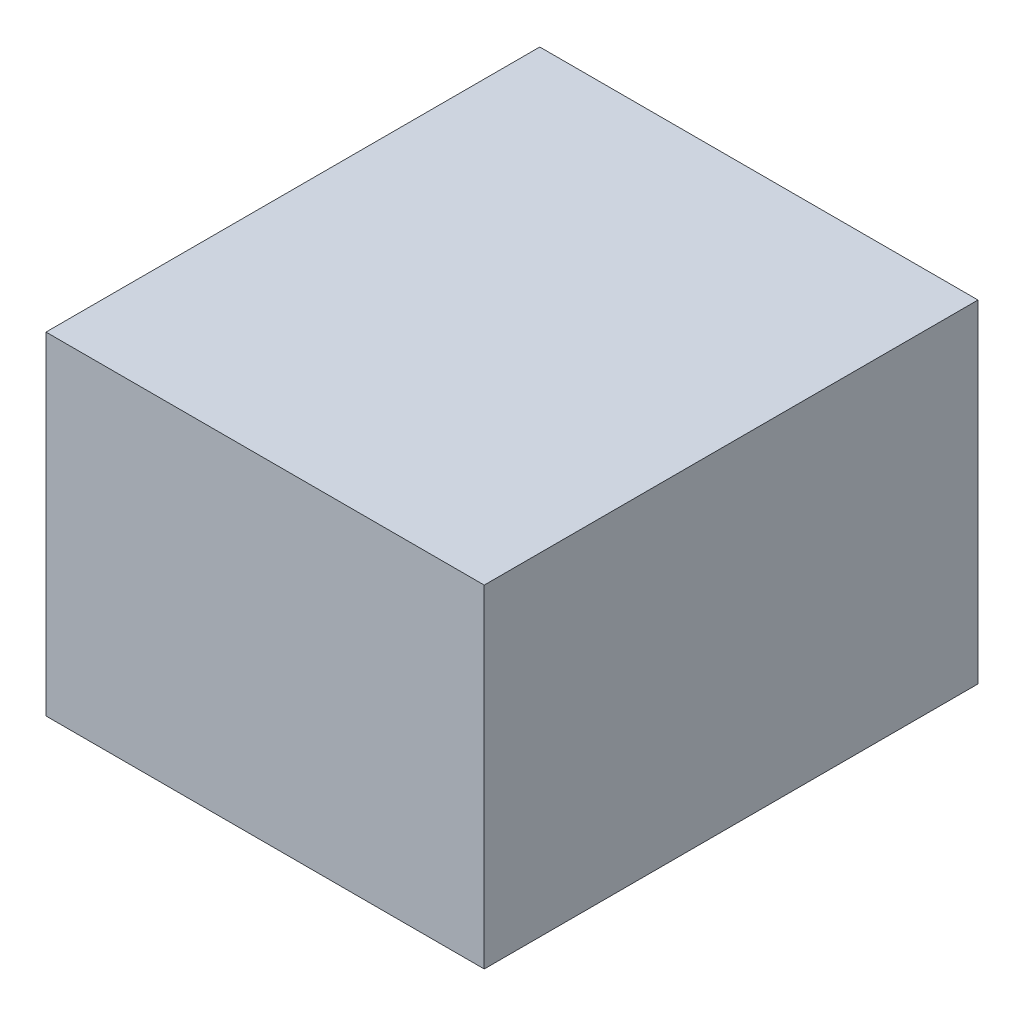
ISO-10303-21;
HEADER;
FILE_DESCRIPTION(('STEP AP214'),'2;1');
FILE_NAME('part.step','',(''),(''),'','','');
FILE_SCHEMA(('AUTOMOTIVE_DESIGN { 1 0 10303 214 1 1 1 1 }'));
ENDSEC;
DATA;
#1=APPLICATION_CONTEXT('core data for automotive mechanical design processes');
#2=APPLICATION_PROTOCOL_DEFINITION('international standard','automotive_design',2000,#1);
#3=PRODUCT_CONTEXT('',#1,'mechanical');
#4=PRODUCT('Part','Part','',(#3));
#5=PRODUCT_RELATED_PRODUCT_CATEGORY('part','',(#4));
#6=PRODUCT_DEFINITION_FORMATION('','',#4);
#7=PRODUCT_DEFINITION_CONTEXT('part definition',#1,'design');
#8=PRODUCT_DEFINITION('design','',#6,#7);
#9=PRODUCT_DEFINITION_SHAPE('','',#8);
#10=(LENGTH_UNIT() NAMED_UNIT(*) SI_UNIT(.MILLI.,.METRE.));
#11=(NAMED_UNIT(*) PLANE_ANGLE_UNIT() SI_UNIT($,.RADIAN.));
#12=(NAMED_UNIT(*) SI_UNIT($,.STERADIAN.) SOLID_ANGLE_UNIT());
#13=UNCERTAINTY_MEASURE_WITH_UNIT(LENGTH_MEASURE(1.E-05),#10,'distance_accuracy_value','');
#14=(GEOMETRIC_REPRESENTATION_CONTEXT(3) GLOBAL_UNCERTAINTY_ASSIGNED_CONTEXT((#13)) GLOBAL_UNIT_ASSIGNED_CONTEXT((#10,
#11,#12)) REPRESENTATION_CONTEXT('',''));
#15=CARTESIAN_POINT('',(0.,0.,0.));
#16=DIRECTION('',(0.,0.,1.));
#17=DIRECTION('',(1.,0.,0.));
#18=AXIS2_PLACEMENT_3D('',#15,#16,#17);
#19=CARTESIAN_POINT('',(-121.76,10.,0.));
#20=DIRECTION('',(-1.,0.,0.));
#21=DIRECTION('',(0.,0.,1.));
#22=AXIS2_PLACEMENT_3D('',#19,#20,#21);
#23=PLANE('',#22);
#24=DIRECTION('',(0.,0.,-1.));
#25=VECTOR('',#24,1.);
#26=CARTESIAN_POINT('',(-121.76,0.,0.));
#27=LINE('',#26,#25);
#28=CARTESIAN_POINT('',(-121.76,0.,-70.84));
#29=VERTEX_POINT('',#28);
#30=CARTESIAN_POINT('',(-121.76,0.,-85.69));
#31=VERTEX_POINT('',#30);
#32=EDGE_CURVE('E101',#29,#31,#27,.T.);
#33=ORIENTED_EDGE('',*,*,#32,.F.);
#34=DIRECTION('',(0.,-1.,0.));
#35=VECTOR('',#34,1.);
#36=CARTESIAN_POINT('',(-121.76,10.,-70.84));
#37=LINE('',#36,#35);
#38=CARTESIAN_POINT('',(-121.76,10.,-70.84));
#39=VERTEX_POINT('',#38);
#40=EDGE_CURVE('E11',#39,#29,#37,.T.);
#41=ORIENTED_EDGE('',*,*,#40,.F.);
#42=DIRECTION('',(0.,0.,-1.));
#43=VECTOR('',#42,1.);
#44=CARTESIAN_POINT('',(-121.76,10.,0.));
#45=LINE('',#44,#43);
#46=CARTESIAN_POINT('',(-121.76,10.,-85.69));
#47=VERTEX_POINT('',#46);
#48=EDGE_CURVE('E94',#39,#47,#45,.T.);
#49=ORIENTED_EDGE('',*,*,#48,.T.);
#50=DIRECTION('',(0.,-1.,0.));
#51=VECTOR('',#50,1.);
#52=CARTESIAN_POINT('',(-121.76,10.,-85.69));
#53=LINE('',#52,#51);
#54=EDGE_CURVE('E75',#47,#31,#53,.T.);
#55=ORIENTED_EDGE('',*,*,#54,.T.);
#56=EDGE_LOOP('',(#33,#41,#49,#55));
#57=FACE_BOUND('',#56,.T.);
#58=ADVANCED_FACE('F37',(#57),#23,.T.);
#59=CARTESIAN_POINT('',(0.,10.,-70.84));
#60=DIRECTION('',(0.,0.,1.));
#61=DIRECTION('',(1.,0.,0.));
#62=AXIS2_PLACEMENT_3D('',#59,#60,#61);
#63=PLANE('',#62);
#64=DIRECTION('',(-1.,0.,0.));
#65=VECTOR('',#64,1.);
#66=CARTESIAN_POINT('',(0.,0.,-70.84));
#67=LINE('',#66,#65);
#68=CARTESIAN_POINT('',(-108.58,0.,-70.84));
#69=VERTEX_POINT('',#68);
#70=EDGE_CURVE('E88',#69,#29,#67,.T.);
#71=ORIENTED_EDGE('',*,*,#70,.F.);
#72=DIRECTION('',(0.,-1.,0.));
#73=VECTOR('',#72,1.);
#74=CARTESIAN_POINT('',(-108.58,10.,-70.84));
#75=LINE('',#74,#73);
#76=CARTESIAN_POINT('',(-108.58,10.,-70.84));
#77=VERTEX_POINT('',#76);
#78=EDGE_CURVE('E45',#77,#69,#75,.T.);
#79=ORIENTED_EDGE('',*,*,#78,.F.);
#80=DIRECTION('',(-1.,0.,0.));
#81=VECTOR('',#80,1.);
#82=CARTESIAN_POINT('',(0.,10.,-70.84));
#83=LINE('',#82,#81);
#84=EDGE_CURVE('E86',#77,#39,#83,.T.);
#85=ORIENTED_EDGE('',*,*,#84,.T.);
#86=ORIENTED_EDGE('',*,*,#40,.T.);
#87=EDGE_LOOP('',(#71,#79,#85,#86));
#88=FACE_BOUND('',#87,.T.);
#89=ADVANCED_FACE('F84',(#88),#63,.T.);
#90=CARTESIAN_POINT('',(-108.58,10.,0.));
#91=DIRECTION('',(-1.,0.,0.));
#92=DIRECTION('',(0.,0.,1.));
#93=AXIS2_PLACEMENT_3D('',#90,#91,#92);
#94=PLANE('',#93);
#95=DIRECTION('',(0.,0.,-1.));
#96=VECTOR('',#95,1.);
#97=CARTESIAN_POINT('',(-108.58,0.,0.));
#98=LINE('',#97,#96);
#99=CARTESIAN_POINT('',(-108.58,0.,-85.69));
#100=VERTEX_POINT('',#99);
#101=EDGE_CURVE('E68',#69,#100,#98,.T.);
#102=ORIENTED_EDGE('',*,*,#101,.T.);
#103=DIRECTION('',(0.,-1.,0.));
#104=VECTOR('',#103,1.);
#105=CARTESIAN_POINT('',(-108.58,10.,-85.69));
#106=LINE('',#105,#104);
#107=CARTESIAN_POINT('',(-108.58,10.,-85.69));
#108=VERTEX_POINT('',#107);
#109=EDGE_CURVE('E89',#108,#100,#106,.T.);
#110=ORIENTED_EDGE('',*,*,#109,.F.);
#111=DIRECTION('',(0.,0.,-1.));
#112=VECTOR('',#111,1.);
#113=CARTESIAN_POINT('',(-108.58,10.,0.));
#114=LINE('',#113,#112);
#115=EDGE_CURVE('E90',#77,#108,#114,.T.);
#116=ORIENTED_EDGE('',*,*,#115,.F.);
#117=ORIENTED_EDGE('',*,*,#78,.T.);
#118=EDGE_LOOP('',(#102,#110,#116,#117));
#119=FACE_BOUND('',#118,.T.);
#120=ADVANCED_FACE('F91',(#119),#94,.F.);
#121=CARTESIAN_POINT('',(0.,10.,-85.69));
#122=DIRECTION('',(0.,0.,1.));
#123=DIRECTION('',(1.,0.,0.));
#124=AXIS2_PLACEMENT_3D('',#121,#122,#123);
#125=PLANE('',#124);
#126=DIRECTION('',(-1.,0.,0.));
#127=VECTOR('',#126,1.);
#128=CARTESIAN_POINT('',(0.,0.,-85.69));
#129=LINE('',#128,#127);
#130=EDGE_CURVE('E96',#100,#31,#129,.T.);
#131=ORIENTED_EDGE('',*,*,#130,.T.);
#132=ORIENTED_EDGE('',*,*,#54,.F.);
#133=DIRECTION('',(-1.,0.,0.));
#134=VECTOR('',#133,1.);
#135=CARTESIAN_POINT('',(0.,10.,-85.69));
#136=LINE('',#135,#134);
#137=EDGE_CURVE('E53',#108,#47,#136,.T.);
#138=ORIENTED_EDGE('',*,*,#137,.F.);
#139=ORIENTED_EDGE('',*,*,#109,.T.);
#140=EDGE_LOOP('',(#131,#132,#138,#139));
#141=FACE_BOUND('',#140,.T.);
#142=ADVANCED_FACE('F111',(#141),#125,.F.);
#143=CARTESIAN_POINT('',(0.,10.,0.));
#144=DIRECTION('',(0.,1.,0.));
#145=DIRECTION('',(0.,0.,1.));
#146=AXIS2_PLACEMENT_3D('',#143,#144,#145);
#147=PLANE('',#146);
#148=ORIENTED_EDGE('',*,*,#48,.F.);
#149=ORIENTED_EDGE('',*,*,#84,.F.);
#150=ORIENTED_EDGE('',*,*,#115,.T.);
#151=ORIENTED_EDGE('',*,*,#137,.T.);
#152=EDGE_LOOP('',(#148,#149,#150,#151));
#153=FACE_BOUND('',#152,.T.);
#154=ADVANCED_FACE('F93',(#153),#147,.T.);
#155=CARTESIAN_POINT('',(0.,0.,0.));
#156=DIRECTION('',(0.,1.,0.));
#157=DIRECTION('',(0.,0.,1.));
#158=AXIS2_PLACEMENT_3D('',#155,#156,#157);
#159=PLANE('',#158);
#160=CARTESIAN_POINT('',(-115.17,0.,-78.265));
#161=DIRECTION('',(0.,-1.,0.));
#162=DIRECTION('',(0.,0.,-1.));
#163=AXIS2_PLACEMENT_3D('',#160,#161,#162);
#164=CIRCLE('',#163,5.00000000000001);
#165=CARTESIAN_POINT('',(-115.17,0.,-83.265));
#166=VERTEX_POINT('',#165);
#167=EDGE_CURVE('E141',#166,#166,#164,.T.);
#168=ORIENTED_EDGE('',*,*,#167,.F.);
#169=EDGE_LOOP('',(#168));
#170=FACE_BOUND('',#169,.T.);
#171=ORIENTED_EDGE('',*,*,#32,.T.);
#172=ORIENTED_EDGE('',*,*,#130,.F.);
#173=ORIENTED_EDGE('',*,*,#101,.F.);
#174=ORIENTED_EDGE('',*,*,#70,.T.);
#175=EDGE_LOOP('',(#171,#172,#173,#174));
#176=FACE_BOUND('',#175,.T.);
#177=ADVANCED_FACE('F113',(#170,#176),#159,.F.);
#178=CARTESIAN_POINT('',(-115.17,5.,-78.265));
#179=DIRECTION('',(0.,-1.,0.));
#180=DIRECTION('',(0.,0.,-1.));
#181=AXIS2_PLACEMENT_3D('',#178,#179,#180);
#182=CYLINDRICAL_SURFACE('',#181,5.00000000000001);
#183=CARTESIAN_POINT('',(-115.17,5.,-78.265));
#184=DIRECTION('',(0.,-1.,0.));
#185=DIRECTION('',(0.,0.,-1.));
#186=AXIS2_PLACEMENT_3D('',#183,#184,#185);
#187=CIRCLE('',#186,5.00000000000001);
#188=CARTESIAN_POINT('',(-115.17,5.,-83.265));
#189=VERTEX_POINT('',#188);
#190=EDGE_CURVE('E104',#189,#189,#187,.T.);
#191=ORIENTED_EDGE('',*,*,#190,.F.);
#192=EDGE_LOOP('',(#191));
#193=FACE_BOUND('',#192,.T.);
#194=ORIENTED_EDGE('',*,*,#167,.T.);
#195=EDGE_LOOP('',(#194));
#196=FACE_BOUND('',#195,.T.);
#197=ADVANCED_FACE('F127',(#193,#196),#182,.F.);
#198=CARTESIAN_POINT('',(0.,5.,0.));
#199=DIRECTION('',(0.,-1.,0.));
#200=DIRECTION('',(0.,0.,-1.));
#201=AXIS2_PLACEMENT_3D('',#198,#199,#200);
#202=PLANE('',#201);
#203=ORIENTED_EDGE('',*,*,#190,.T.);
#204=EDGE_LOOP('',(#203));
#205=FACE_BOUND('',#204,.T.);
#206=ADVANCED_FACE('F133',(#205),#202,.T.);
#207=CLOSED_SHELL('',(#58,#89,#120,#142,#154,#177,#197,#206));
#208=MANIFOLD_SOLID_BREP('B2',#207);
#209=ADVANCED_BREP_SHAPE_REPRESENTATION('',(#18,#208),#14);
#210=SHAPE_DEFINITION_REPRESENTATION(#9,#209);
ENDSEC;
END-ISO-10303-21;
